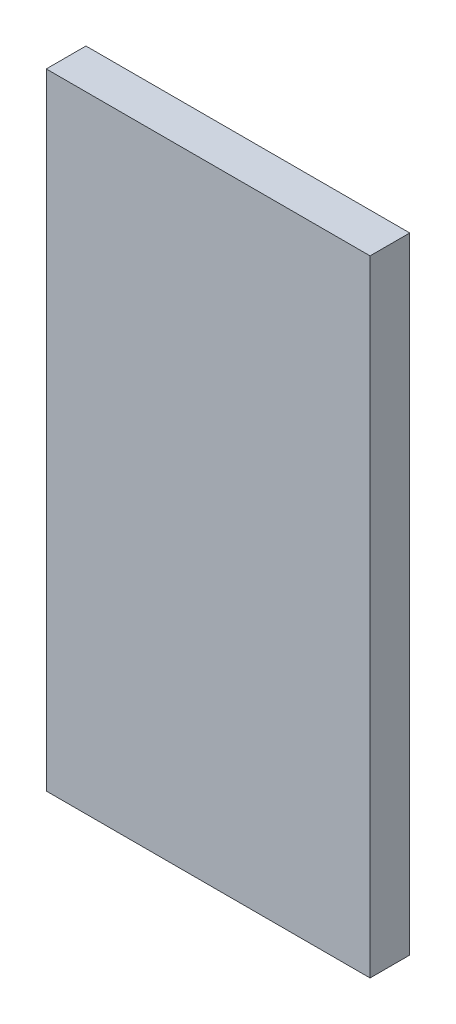
ISO-10303-21;
HEADER;
FILE_DESCRIPTION(('STEP AP214'),'2;1');
FILE_NAME('part.step','',(''),(''),'','','');
FILE_SCHEMA(('AUTOMOTIVE_DESIGN { 1 0 10303 214 1 1 1 1 }'));
ENDSEC;
DATA;
#1=APPLICATION_CONTEXT('core data for automotive mechanical design processes');
#2=APPLICATION_PROTOCOL_DEFINITION('international standard','automotive_design',2000,#1);
#3=PRODUCT_CONTEXT('',#1,'mechanical');
#4=PRODUCT('Part','Part','',(#3));
#5=PRODUCT_RELATED_PRODUCT_CATEGORY('part','',(#4));
#6=PRODUCT_DEFINITION_FORMATION('','',#4);
#7=PRODUCT_DEFINITION_CONTEXT('part definition',#1,'design');
#8=PRODUCT_DEFINITION('design','',#6,#7);
#9=PRODUCT_DEFINITION_SHAPE('','',#8);
#10=(LENGTH_UNIT() NAMED_UNIT(*) SI_UNIT(.MILLI.,.METRE.));
#11=(NAMED_UNIT(*) PLANE_ANGLE_UNIT() SI_UNIT($,.RADIAN.));
#12=(NAMED_UNIT(*) SI_UNIT($,.STERADIAN.) SOLID_ANGLE_UNIT());
#13=UNCERTAINTY_MEASURE_WITH_UNIT(LENGTH_MEASURE(1.E-05),#10,'distance_accuracy_value','');
#14=(GEOMETRIC_REPRESENTATION_CONTEXT(3) GLOBAL_UNCERTAINTY_ASSIGNED_CONTEXT((#13)) GLOBAL_UNIT_ASSIGNED_CONTEXT((#10,
#11,#12)) REPRESENTATION_CONTEXT('',''));
#15=CARTESIAN_POINT('',(0.,0.,0.));
#16=DIRECTION('',(0.,0.,1.));
#17=DIRECTION('',(1.,0.,0.));
#18=AXIS2_PLACEMENT_3D('',#15,#16,#17);
#19=CARTESIAN_POINT('',(-10.568,-3.698,0.1));
#20=DIRECTION('',(0.,0.,1.));
#21=DIRECTION('',(1.,0.,0.));
#22=AXIS2_PLACEMENT_3D('',#19,#20,#21);
#23=PLANE('',#22);
#24=DIRECTION('',(0.,1.,0.));
#25=VECTOR('',#24,1.);
#26=CARTESIAN_POINT('',(-9.752,-3.698,0.1));
#27=LINE('',#26,#25);
#28=CARTESIAN_POINT('',(-9.752,-2.122,0.1));
#29=VERTEX_POINT('',#28);
#30=CARTESIAN_POINT('',(-9.752,-3.698,0.1));
#31=VERTEX_POINT('',#30);
#32=EDGE_CURVE('E75',#29,#31,#27,.F.);
#33=ORIENTED_EDGE('',*,*,#32,.F.);
#34=DIRECTION('',(1.,0.,0.));
#35=VECTOR('',#34,1.);
#36=CARTESIAN_POINT('',(-10.568,-2.122,0.1));
#37=LINE('',#36,#35);
#38=CARTESIAN_POINT('',(-10.568,-2.122,0.1));
#39=VERTEX_POINT('',#38);
#40=EDGE_CURVE('E57',#39,#29,#37,.T.);
#41=ORIENTED_EDGE('',*,*,#40,.F.);
#42=DIRECTION('',(0.,1.,0.));
#43=VECTOR('',#42,1.);
#44=CARTESIAN_POINT('',(-10.568,-3.698,0.1));
#45=LINE('',#44,#43);
#46=CARTESIAN_POINT('',(-10.568,-3.698,0.1));
#47=VERTEX_POINT('',#46);
#48=EDGE_CURVE('E19',#39,#47,#45,.F.);
#49=ORIENTED_EDGE('',*,*,#48,.T.);
#50=DIRECTION('',(1.,0.,0.));
#51=VECTOR('',#50,1.);
#52=CARTESIAN_POINT('',(-10.568,-3.698,0.1));
#53=LINE('',#52,#51);
#54=EDGE_CURVE('E54',#47,#31,#53,.T.);
#55=ORIENTED_EDGE('',*,*,#54,.T.);
#56=EDGE_LOOP('',(#33,#41,#49,#55));
#57=FACE_BOUND('',#56,.T.);
#58=ADVANCED_FACE('F16',(#57),#23,.T.);
#59=CARTESIAN_POINT('',(-10.568,-3.698,0.));
#60=DIRECTION('',(1.,0.,0.));
#61=DIRECTION('',(0.,0.,-1.));
#62=AXIS2_PLACEMENT_3D('',#59,#60,#61);
#63=PLANE('',#62);
#64=DIRECTION('',(0.,0.,1.));
#65=VECTOR('',#64,1.);
#66=CARTESIAN_POINT('',(-10.568,-2.122,0.));
#67=LINE('',#66,#65);
#68=CARTESIAN_POINT('',(-10.568,-2.122,0.));
#69=VERTEX_POINT('',#68);
#70=EDGE_CURVE('E77',#69,#39,#67,.T.);
#71=ORIENTED_EDGE('',*,*,#70,.F.);
#72=DIRECTION('',(0.,1.,0.));
#73=VECTOR('',#72,1.);
#74=CARTESIAN_POINT('',(-10.568,-3.698,0.));
#75=LINE('',#74,#73);
#76=CARTESIAN_POINT('',(-10.568,-3.698,0.));
#77=VERTEX_POINT('',#76);
#78=EDGE_CURVE('E72',#69,#77,#75,.F.);
#79=ORIENTED_EDGE('',*,*,#78,.T.);
#80=DIRECTION('',(0.,0.,1.));
#81=VECTOR('',#80,1.);
#82=CARTESIAN_POINT('',(-10.568,-3.698,0.));
#83=LINE('',#82,#81);
#84=EDGE_CURVE('E62',#77,#47,#83,.T.);
#85=ORIENTED_EDGE('',*,*,#84,.T.);
#86=ORIENTED_EDGE('',*,*,#48,.F.);
#87=EDGE_LOOP('',(#71,#79,#85,#86));
#88=FACE_BOUND('',#87,.T.);
#89=ADVANCED_FACE('F71',(#88),#63,.F.);
#90=CARTESIAN_POINT('',(-10.568,-3.698,0.));
#91=DIRECTION('',(0.,1.,0.));
#92=DIRECTION('',(0.,0.,1.));
#93=AXIS2_PLACEMENT_3D('',#90,#91,#92);
#94=PLANE('',#93);
#95=ORIENTED_EDGE('',*,*,#54,.F.);
#96=ORIENTED_EDGE('',*,*,#84,.F.);
#97=DIRECTION('',(1.,0.,0.));
#98=VECTOR('',#97,1.);
#99=CARTESIAN_POINT('',(-10.568,-3.698,0.));
#100=LINE('',#99,#98);
#101=CARTESIAN_POINT('',(-9.752,-3.698,0.));
#102=VERTEX_POINT('',#101);
#103=EDGE_CURVE('E82',#77,#102,#100,.T.);
#104=ORIENTED_EDGE('',*,*,#103,.T.);
#105=DIRECTION('',(0.,0.,-1.));
#106=VECTOR('',#105,1.);
#107=CARTESIAN_POINT('',(-9.752,-3.698,0.));
#108=LINE('',#107,#106);
#109=EDGE_CURVE('E68',#31,#102,#108,.T.);
#110=ORIENTED_EDGE('',*,*,#109,.F.);
#111=EDGE_LOOP('',(#95,#96,#104,#110));
#112=FACE_BOUND('',#111,.T.);
#113=ADVANCED_FACE('F65',(#112),#94,.F.);
#114=CARTESIAN_POINT('',(-9.752,-3.698,0.));
#115=DIRECTION('',(1.,0.,0.));
#116=DIRECTION('',(0.,0.,-1.));
#117=AXIS2_PLACEMENT_3D('',#114,#115,#116);
#118=PLANE('',#117);
#119=DIRECTION('',(0.,0.,1.));
#120=VECTOR('',#119,1.);
#121=CARTESIAN_POINT('',(-9.752,-2.122,0.));
#122=LINE('',#121,#120);
#123=CARTESIAN_POINT('',(-9.752,-2.122,0.));
#124=VERTEX_POINT('',#123);
#125=EDGE_CURVE('E33',#29,#124,#122,.F.);
#126=ORIENTED_EDGE('',*,*,#125,.F.);
#127=ORIENTED_EDGE('',*,*,#32,.T.);
#128=ORIENTED_EDGE('',*,*,#109,.T.);
#129=DIRECTION('',(0.,1.,0.));
#130=VECTOR('',#129,1.);
#131=CARTESIAN_POINT('',(-9.752,-3.698,0.));
#132=LINE('',#131,#130);
#133=EDGE_CURVE('E25',#102,#124,#132,.T.);
#134=ORIENTED_EDGE('',*,*,#133,.T.);
#135=EDGE_LOOP('',(#126,#127,#128,#134));
#136=FACE_BOUND('',#135,.T.);
#137=ADVANCED_FACE('F87',(#136),#118,.T.);
#138=CARTESIAN_POINT('',(-10.568,-2.122,0.));
#139=DIRECTION('',(0.,1.,0.));
#140=DIRECTION('',(0.,0.,1.));
#141=AXIS2_PLACEMENT_3D('',#138,#139,#140);
#142=PLANE('',#141);
#143=ORIENTED_EDGE('',*,*,#40,.T.);
#144=ORIENTED_EDGE('',*,*,#125,.T.);
#145=DIRECTION('',(1.,0.,0.));
#146=VECTOR('',#145,1.);
#147=CARTESIAN_POINT('',(-10.568,-2.122,0.));
#148=LINE('',#147,#146);
#149=EDGE_CURVE('E11',#124,#69,#148,.F.);
#150=ORIENTED_EDGE('',*,*,#149,.T.);
#151=ORIENTED_EDGE('',*,*,#70,.T.);
#152=EDGE_LOOP('',(#143,#144,#150,#151));
#153=FACE_BOUND('',#152,.T.);
#154=ADVANCED_FACE('F90',(#153),#142,.T.);
#155=CARTESIAN_POINT('',(-10.568,-3.698,0.));
#156=DIRECTION('',(0.,0.,1.));
#157=DIRECTION('',(1.,0.,0.));
#158=AXIS2_PLACEMENT_3D('',#155,#156,#157);
#159=PLANE('',#158);
#160=ORIENTED_EDGE('',*,*,#133,.F.);
#161=ORIENTED_EDGE('',*,*,#103,.F.);
#162=ORIENTED_EDGE('',*,*,#78,.F.);
#163=ORIENTED_EDGE('',*,*,#149,.F.);
#164=EDGE_LOOP('',(#160,#161,#162,#163));
#165=FACE_BOUND('',#164,.T.);
#166=ADVANCED_FACE('F89',(#165),#159,.F.);
#167=CLOSED_SHELL('',(#58,#89,#113,#137,#154,#166));
#168=MANIFOLD_SOLID_BREP('B1',#167);
#169=ADVANCED_BREP_SHAPE_REPRESENTATION('',(#18,#168),#14);
#170=SHAPE_DEFINITION_REPRESENTATION(#9,#169);
ENDSEC;
END-ISO-10303-21;
